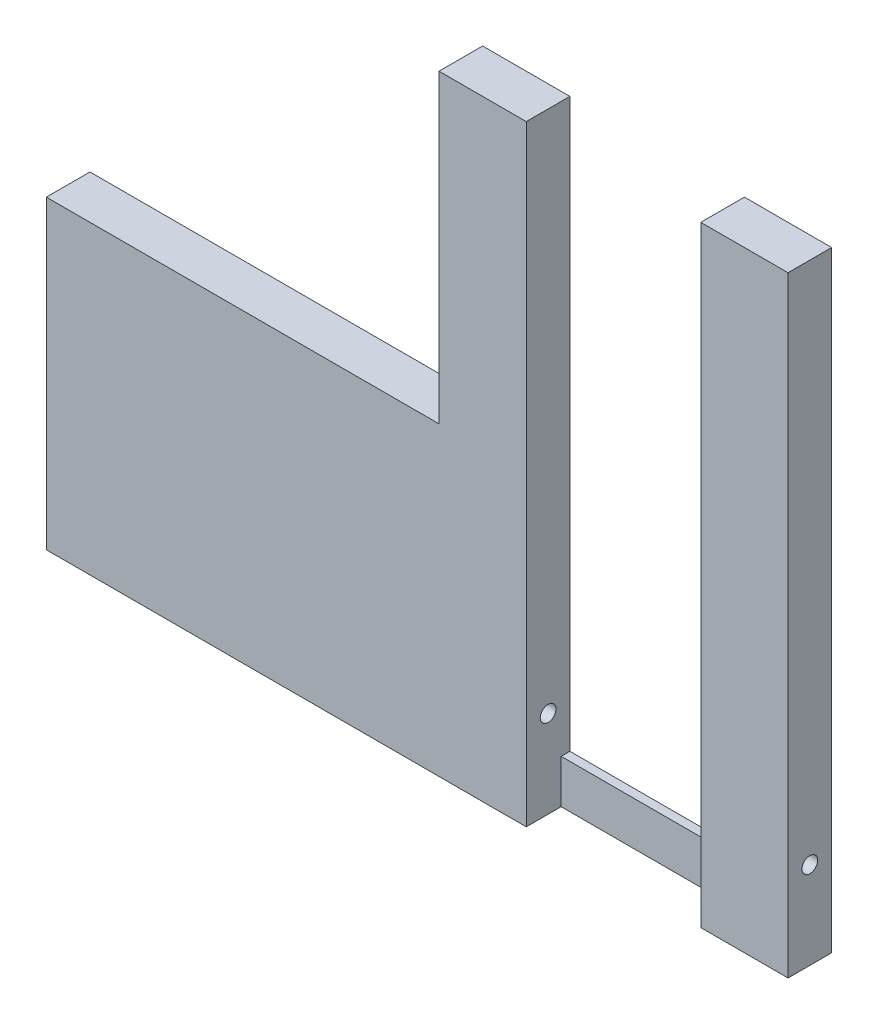
ISO-10303-21;
HEADER;
FILE_DESCRIPTION(('STEP AP214'),'2;1');
FILE_NAME('part.step','',(''),(''),'','','');
FILE_SCHEMA(('AUTOMOTIVE_DESIGN { 1 0 10303 214 1 1 1 1 }'));
ENDSEC;
DATA;
#1=APPLICATION_CONTEXT('core data for automotive mechanical design processes');
#2=APPLICATION_PROTOCOL_DEFINITION('international standard','automotive_design',2000,#1);
#3=PRODUCT_CONTEXT('',#1,'mechanical');
#4=PRODUCT('Part','Part','',(#3));
#5=PRODUCT_RELATED_PRODUCT_CATEGORY('part','',(#4));
#6=PRODUCT_DEFINITION_FORMATION('','',#4);
#7=PRODUCT_DEFINITION_CONTEXT('part definition',#1,'design');
#8=PRODUCT_DEFINITION('design','',#6,#7);
#9=PRODUCT_DEFINITION_SHAPE('','',#8);
#10=(LENGTH_UNIT() NAMED_UNIT(*) SI_UNIT(.MILLI.,.METRE.));
#11=(NAMED_UNIT(*) PLANE_ANGLE_UNIT() SI_UNIT($,.RADIAN.));
#12=(NAMED_UNIT(*) SI_UNIT($,.STERADIAN.) SOLID_ANGLE_UNIT());
#13=UNCERTAINTY_MEASURE_WITH_UNIT(LENGTH_MEASURE(1.E-05),#10,'distance_accuracy_value','');
#14=(GEOMETRIC_REPRESENTATION_CONTEXT(3) GLOBAL_UNCERTAINTY_ASSIGNED_CONTEXT((#13)) GLOBAL_UNIT_ASSIGNED_CONTEXT((#10,
#11,#12)) REPRESENTATION_CONTEXT('',''));
#15=CARTESIAN_POINT('',(0.,0.,0.));
#16=DIRECTION('',(0.,0.,1.));
#17=DIRECTION('',(1.,0.,0.));
#18=AXIS2_PLACEMENT_3D('',#15,#16,#17);
#19=CARTESIAN_POINT('',(0.,0.,2.));
#20=DIRECTION('',(1.,0.,0.));
#21=DIRECTION('',(0.,0.,-1.));
#22=AXIS2_PLACEMENT_3D('',#19,#20,#21);
#23=PLANE('',#22);
#24=DIRECTION('',(0.,0.,-1.));
#25=VECTOR('',#24,1.);
#26=CARTESIAN_POINT('',(0.,14.,0.));
#27=LINE('',#26,#25);
#28=CARTESIAN_POINT('',(0.,14.,2.));
#29=VERTEX_POINT('',#28);
#30=CARTESIAN_POINT('',(0.,14.,0.));
#31=VERTEX_POINT('',#30);
#32=EDGE_CURVE('E55',#29,#31,#27,.T.);
#33=ORIENTED_EDGE('',*,*,#32,.F.);
#34=DIRECTION('',(0.,-1.,0.));
#35=VECTOR('',#34,1.);
#36=CARTESIAN_POINT('',(0.,0.,2.));
#37=LINE('',#36,#35);
#38=CARTESIAN_POINT('',(0.,28.,2.));
#39=VERTEX_POINT('',#38);
#40=EDGE_CURVE('E233',#39,#29,#37,.T.);
#41=ORIENTED_EDGE('',*,*,#40,.F.);
#42=DIRECTION('',(0.,0.,-1.));
#43=VECTOR('',#42,1.);
#44=CARTESIAN_POINT('',(0.,28.,2.));
#45=LINE('',#44,#43);
#46=CARTESIAN_POINT('',(0.,28.,0.));
#47=VERTEX_POINT('',#46);
#48=EDGE_CURVE('E245',#39,#47,#45,.T.);
#49=ORIENTED_EDGE('',*,*,#48,.T.);
#50=DIRECTION('',(0.,-1.,0.));
#51=VECTOR('',#50,1.);
#52=CARTESIAN_POINT('',(0.,0.,0.));
#53=LINE('',#52,#51);
#54=EDGE_CURVE('E143',#47,#31,#53,.T.);
#55=ORIENTED_EDGE('',*,*,#54,.T.);
#56=EDGE_LOOP('',(#33,#41,#49,#55));
#57=FACE_BOUND('',#56,.T.);
#58=ADVANCED_FACE('F40',(#57),#23,.F.);
#59=CARTESIAN_POINT('',(0.,0.,0.400000000000001));
#60=DIRECTION('',(0.,0.,-1.));
#61=DIRECTION('',(-1.,0.,0.));
#62=AXIS2_PLACEMENT_3D('',#59,#60,#61);
#63=PLANE('',#62);
#64=DIRECTION('',(0.,-1.,0.));
#65=VECTOR('',#64,1.);
#66=CARTESIAN_POINT('',(12.,0.,0.400000000000001));
#67=LINE('',#66,#65);
#68=CARTESIAN_POINT('',(12.,2.,0.400000000000001));
#69=VERTEX_POINT('',#68);
#70=CARTESIAN_POINT('',(12.,0.,0.400000000000001));
#71=VERTEX_POINT('',#70);
#72=EDGE_CURVE('E211',#69,#71,#67,.T.);
#73=ORIENTED_EDGE('',*,*,#72,.F.);
#74=DIRECTION('',(1.,0.,0.));
#75=VECTOR('',#74,1.);
#76=CARTESIAN_POINT('',(0.,2.,0.400000000000001));
#77=LINE('',#76,#75);
#78=CARTESIAN_POINT('',(4.,2.,0.400000000000001));
#79=VERTEX_POINT('',#78);
#80=EDGE_CURVE('E215',#79,#69,#77,.T.);
#81=ORIENTED_EDGE('',*,*,#80,.F.);
#82=DIRECTION('',(0.,-1.,0.));
#83=VECTOR('',#82,1.);
#84=CARTESIAN_POINT('',(4.,0.,0.400000000000001));
#85=LINE('',#84,#83);
#86=CARTESIAN_POINT('',(4.,0.,0.400000000000001));
#87=VERTEX_POINT('',#86);
#88=EDGE_CURVE('E48',#79,#87,#85,.T.);
#89=ORIENTED_EDGE('',*,*,#88,.T.);
#90=DIRECTION('',(-1.,0.,0.));
#91=VECTOR('',#90,1.);
#92=CARTESIAN_POINT('',(0.,0.,0.400000000000001));
#93=LINE('',#92,#91);
#94=EDGE_CURVE('E219',#71,#87,#93,.T.);
#95=ORIENTED_EDGE('',*,*,#94,.F.);
#96=EDGE_LOOP('',(#73,#81,#89,#95));
#97=FACE_BOUND('',#96,.T.);
#98=ADVANCED_FACE('F267',(#97),#63,.F.);
#99=CARTESIAN_POINT('',(0.,2.,0.400000000000001));
#100=DIRECTION('',(0.,1.,0.));
#101=DIRECTION('',(-1.,0.,0.));
#102=AXIS2_PLACEMENT_3D('',#99,#100,#101);
#103=PLANE('',#102);
#104=ORIENTED_EDGE('',*,*,#80,.T.);
#105=DIRECTION('',(0.,0.,-1.));
#106=VECTOR('',#105,1.);
#107=CARTESIAN_POINT('',(12.,2.,0.400000000000001));
#108=LINE('',#107,#106);
#109=CARTESIAN_POINT('',(12.,2.,0.));
#110=VERTEX_POINT('',#109);
#111=EDGE_CURVE('E11',#69,#110,#108,.T.);
#112=ORIENTED_EDGE('',*,*,#111,.T.);
#113=DIRECTION('',(1.,0.,0.));
#114=VECTOR('',#113,1.);
#115=CARTESIAN_POINT('',(0.,2.,0.));
#116=LINE('',#115,#114);
#117=CARTESIAN_POINT('',(4.,2.,0.));
#118=VERTEX_POINT('',#117);
#119=EDGE_CURVE('E214',#118,#110,#116,.T.);
#120=ORIENTED_EDGE('',*,*,#119,.F.);
#121=DIRECTION('',(0.,0.,-1.));
#122=VECTOR('',#121,1.);
#123=CARTESIAN_POINT('',(4.,2.,2.));
#124=LINE('',#123,#122);
#125=EDGE_CURVE('E230',#79,#118,#124,.T.);
#126=ORIENTED_EDGE('',*,*,#125,.F.);
#127=EDGE_LOOP('',(#104,#112,#120,#126));
#128=FACE_BOUND('',#127,.T.);
#129=ADVANCED_FACE('F269',(#128),#103,.T.);
#130=CARTESIAN_POINT('',(0.,0.,2.));
#131=DIRECTION('',(0.,1.,0.));
#132=DIRECTION('',(0.,0.,1.));
#133=AXIS2_PLACEMENT_3D('',#130,#131,#132);
#134=PLANE('',#133);
#135=DIRECTION('',(0.,0.,-1.));
#136=VECTOR('',#135,1.);
#137=CARTESIAN_POINT('',(16.,0.,0.400000000000001));
#138=LINE('',#137,#136);
#139=CARTESIAN_POINT('',(16.,0.,2.));
#140=VERTEX_POINT('',#139);
#141=CARTESIAN_POINT('',(16.,0.,0.));
#142=VERTEX_POINT('',#141);
#143=EDGE_CURVE('E222',#140,#142,#138,.T.);
#144=ORIENTED_EDGE('',*,*,#143,.F.);
#145=DIRECTION('',(1.,0.,0.));
#146=VECTOR('',#145,1.);
#147=CARTESIAN_POINT('',(12.,0.,2.));
#148=LINE('',#147,#146);
#149=CARTESIAN_POINT('',(12.,0.,2.));
#150=VERTEX_POINT('',#149);
#151=EDGE_CURVE('E184',#150,#140,#148,.T.);
#152=ORIENTED_EDGE('',*,*,#151,.F.);
#153=DIRECTION('',(0.,0.,-1.));
#154=VECTOR('',#153,1.);
#155=CARTESIAN_POINT('',(12.,0.,2.));
#156=LINE('',#155,#154);
#157=EDGE_CURVE('E207',#150,#71,#156,.T.);
#158=ORIENTED_EDGE('',*,*,#157,.T.);
#159=ORIENTED_EDGE('',*,*,#94,.T.);
#160=DIRECTION('',(0.,0.,-1.));
#161=VECTOR('',#160,1.);
#162=CARTESIAN_POINT('',(4.,0.,2.));
#163=LINE('',#162,#161);
#164=CARTESIAN_POINT('',(4.,0.,2.));
#165=VERTEX_POINT('',#164);
#166=EDGE_CURVE('E259',#165,#87,#163,.T.);
#167=ORIENTED_EDGE('',*,*,#166,.F.);
#168=DIRECTION('',(1.,0.,0.));
#169=VECTOR('',#168,1.);
#170=CARTESIAN_POINT('',(0.,0.,2.));
#171=LINE('',#170,#169);
#172=CARTESIAN_POINT('',(-18.,0.,2.));
#173=VERTEX_POINT('',#172);
#174=EDGE_CURVE('E149',#173,#165,#171,.T.);
#175=ORIENTED_EDGE('',*,*,#174,.F.);
#176=DIRECTION('',(0.,0.,1.));
#177=VECTOR('',#176,1.);
#178=CARTESIAN_POINT('',(-18.,0.,0.));
#179=LINE('',#178,#177);
#180=CARTESIAN_POINT('',(-18.,0.,0.));
#181=VERTEX_POINT('',#180);
#182=EDGE_CURVE('E146',#181,#173,#179,.T.);
#183=ORIENTED_EDGE('',*,*,#182,.F.);
#184=DIRECTION('',(1.,0.,0.));
#185=VECTOR('',#184,1.);
#186=CARTESIAN_POINT('',(0.,0.,0.));
#187=LINE('',#186,#185);
#188=EDGE_CURVE('E131',#181,#142,#187,.T.);
#189=ORIENTED_EDGE('',*,*,#188,.T.);
#190=EDGE_LOOP('',(#144,#152,#158,#159,#167,#175,#183,#189));
#191=FACE_BOUND('',#190,.T.);
#192=ADVANCED_FACE('F147',(#191),#134,.F.);
#193=CARTESIAN_POINT('',(4.,0.,2.));
#194=DIRECTION('',(-1.,0.,0.));
#195=DIRECTION('',(0.,0.,1.));
#196=AXIS2_PLACEMENT_3D('',#193,#194,#195);
#197=PLANE('',#196);
#198=CARTESIAN_POINT('',(4.,4.,1.));
#199=DIRECTION('',(-1.,0.,0.));
#200=DIRECTION('',(0.,0.,1.));
#201=AXIS2_PLACEMENT_3D('',#198,#199,#200);
#202=CIRCLE('',#201,0.36);
#203=CARTESIAN_POINT('',(4.,4.,1.36));
#204=VERTEX_POINT('',#203);
#205=EDGE_CURVE('E163',#204,#204,#202,.T.);
#206=ORIENTED_EDGE('',*,*,#205,.T.);
#207=EDGE_LOOP('',(#206));
#208=FACE_BOUND('',#207,.T.);
#209=ORIENTED_EDGE('',*,*,#88,.F.);
#210=ORIENTED_EDGE('',*,*,#125,.T.);
#211=DIRECTION('',(0.,1.,0.));
#212=VECTOR('',#211,1.);
#213=CARTESIAN_POINT('',(4.,0.,0.));
#214=LINE('',#213,#212);
#215=CARTESIAN_POINT('',(4.,28.,0.));
#216=VERTEX_POINT('',#215);
#217=EDGE_CURVE('E142',#118,#216,#214,.T.);
#218=ORIENTED_EDGE('',*,*,#217,.T.);
#219=DIRECTION('',(0.,0.,-1.));
#220=VECTOR('',#219,1.);
#221=CARTESIAN_POINT('',(4.,28.,2.));
#222=LINE('',#221,#220);
#223=CARTESIAN_POINT('',(4.,28.,2.));
#224=VERTEX_POINT('',#223);
#225=EDGE_CURVE('E255',#224,#216,#222,.T.);
#226=ORIENTED_EDGE('',*,*,#225,.F.);
#227=DIRECTION('',(0.,1.,0.));
#228=VECTOR('',#227,1.);
#229=CARTESIAN_POINT('',(4.,0.,2.));
#230=LINE('',#229,#228);
#231=EDGE_CURVE('E239',#165,#224,#230,.T.);
#232=ORIENTED_EDGE('',*,*,#231,.F.);
#233=ORIENTED_EDGE('',*,*,#166,.T.);
#234=EDGE_LOOP('',(#209,#210,#218,#226,#232,#233));
#235=FACE_BOUND('',#234,.T.);
#236=ADVANCED_FACE('F271',(#208,#235),#197,.F.);
#237=CARTESIAN_POINT('',(0.,28.,2.));
#238=DIRECTION('',(0.,-1.,0.));
#239=DIRECTION('',(0.,0.,-1.));
#240=AXIS2_PLACEMENT_3D('',#237,#238,#239);
#241=PLANE('',#240);
#242=DIRECTION('',(-1.,0.,0.));
#243=VECTOR('',#242,1.);
#244=CARTESIAN_POINT('',(0.,28.,0.));
#245=LINE('',#244,#243);
#246=EDGE_CURVE('E236',#216,#47,#245,.T.);
#247=ORIENTED_EDGE('',*,*,#246,.T.);
#248=ORIENTED_EDGE('',*,*,#48,.F.);
#249=DIRECTION('',(-1.,0.,0.));
#250=VECTOR('',#249,1.);
#251=CARTESIAN_POINT('',(0.,28.,2.));
#252=LINE('',#251,#250);
#253=EDGE_CURVE('E242',#224,#39,#252,.T.);
#254=ORIENTED_EDGE('',*,*,#253,.F.);
#255=ORIENTED_EDGE('',*,*,#225,.T.);
#256=EDGE_LOOP('',(#247,#248,#254,#255));
#257=FACE_BOUND('',#256,.T.);
#258=ADVANCED_FACE('F277',(#257),#241,.F.);
#259=CARTESIAN_POINT('',(0.,0.,2.));
#260=DIRECTION('',(0.,0.,-1.));
#261=DIRECTION('',(-1.,0.,0.));
#262=AXIS2_PLACEMENT_3D('',#259,#260,#261);
#263=PLANE('',#262);
#264=ORIENTED_EDGE('',*,*,#40,.T.);
#265=DIRECTION('',(1.,0.,0.));
#266=VECTOR('',#265,1.);
#267=CARTESIAN_POINT('',(-18.,14.,2.));
#268=LINE('',#267,#266);
#269=CARTESIAN_POINT('',(-18.,14.,2.));
#270=VERTEX_POINT('',#269);
#271=EDGE_CURVE('E175',#270,#29,#268,.T.);
#272=ORIENTED_EDGE('',*,*,#271,.F.);
#273=DIRECTION('',(0.,1.,0.));
#274=VECTOR('',#273,1.);
#275=CARTESIAN_POINT('',(-18.,0.,2.));
#276=LINE('',#275,#274);
#277=EDGE_CURVE('E153',#173,#270,#276,.T.);
#278=ORIENTED_EDGE('',*,*,#277,.F.);
#279=ORIENTED_EDGE('',*,*,#174,.T.);
#280=ORIENTED_EDGE('',*,*,#231,.T.);
#281=ORIENTED_EDGE('',*,*,#253,.T.);
#282=EDGE_LOOP('',(#264,#272,#278,#279,#280,#281));
#283=FACE_BOUND('',#282,.T.);
#284=ADVANCED_FACE('F284',(#283),#263,.F.);
#285=CARTESIAN_POINT('',(0.,0.,0.));
#286=DIRECTION('',(0.,0.,-1.));
#287=DIRECTION('',(-1.,0.,0.));
#288=AXIS2_PLACEMENT_3D('',#285,#286,#287);
#289=PLANE('',#288);
#290=DIRECTION('',(0.,-1.,0.));
#291=VECTOR('',#290,1.);
#292=CARTESIAN_POINT('',(16.,0.,0.));
#293=LINE('',#292,#291);
#294=CARTESIAN_POINT('',(16.,28.,0.));
#295=VERTEX_POINT('',#294);
#296=EDGE_CURVE('E138',#295,#142,#293,.T.);
#297=ORIENTED_EDGE('',*,*,#296,.T.);
#298=ORIENTED_EDGE('',*,*,#188,.F.);
#299=DIRECTION('',(0.,-1.,0.));
#300=VECTOR('',#299,1.);
#301=CARTESIAN_POINT('',(-18.,0.,0.));
#302=LINE('',#301,#300);
#303=CARTESIAN_POINT('',(-18.,14.,0.));
#304=VERTEX_POINT('',#303);
#305=EDGE_CURVE('E136',#304,#181,#302,.T.);
#306=ORIENTED_EDGE('',*,*,#305,.F.);
#307=DIRECTION('',(1.,0.,0.));
#308=VECTOR('',#307,1.);
#309=CARTESIAN_POINT('',(-18.,14.,0.));
#310=LINE('',#309,#308);
#311=EDGE_CURVE('E171',#304,#31,#310,.T.);
#312=ORIENTED_EDGE('',*,*,#311,.T.);
#313=ORIENTED_EDGE('',*,*,#54,.F.);
#314=ORIENTED_EDGE('',*,*,#246,.F.);
#315=ORIENTED_EDGE('',*,*,#217,.F.);
#316=ORIENTED_EDGE('',*,*,#119,.T.);
#317=DIRECTION('',(0.,-1.,0.));
#318=VECTOR('',#317,1.);
#319=CARTESIAN_POINT('',(12.,0.,0.));
#320=LINE('',#319,#318);
#321=CARTESIAN_POINT('',(12.,28.,0.));
#322=VERTEX_POINT('',#321);
#323=EDGE_CURVE('E179',#322,#110,#320,.T.);
#324=ORIENTED_EDGE('',*,*,#323,.F.);
#325=DIRECTION('',(-1.,0.,0.));
#326=VECTOR('',#325,1.);
#327=CARTESIAN_POINT('',(12.,28.,0.));
#328=LINE('',#327,#326);
#329=EDGE_CURVE('E185',#295,#322,#328,.T.);
#330=ORIENTED_EDGE('',*,*,#329,.F.);
#331=EDGE_LOOP('',(#297,#298,#306,#312,#313,#314,#315,#316,#324,#330));
#332=FACE_BOUND('',#331,.T.);
#333=ADVANCED_FACE('F133',(#332),#289,.T.);
#334=CARTESIAN_POINT('',(16.,0.,0.400000000000001));
#335=DIRECTION('',(1.,0.,0.));
#336=DIRECTION('',(0.,0.,-1.));
#337=AXIS2_PLACEMENT_3D('',#334,#335,#336);
#338=PLANE('',#337);
#339=CARTESIAN_POINT('',(16.,4.,1.));
#340=DIRECTION('',(1.,0.,0.));
#341=DIRECTION('',(0.,0.,-1.));
#342=AXIS2_PLACEMENT_3D('',#339,#340,#341);
#343=CIRCLE('',#342,0.36);
#344=CARTESIAN_POINT('',(16.,4.,0.640000000000001));
#345=VERTEX_POINT('',#344);
#346=EDGE_CURVE('E411',#345,#345,#343,.T.);
#347=ORIENTED_EDGE('',*,*,#346,.F.);
#348=EDGE_LOOP('',(#347));
#349=FACE_BOUND('',#348,.T.);
#350=DIRECTION('',(0.,1.,0.));
#351=VECTOR('',#350,1.);
#352=CARTESIAN_POINT('',(16.,0.,2.));
#353=LINE('',#352,#351);
#354=CARTESIAN_POINT('',(16.,28.,2.));
#355=VERTEX_POINT('',#354);
#356=EDGE_CURVE('E189',#140,#355,#353,.T.);
#357=ORIENTED_EDGE('',*,*,#356,.F.);
#358=ORIENTED_EDGE('',*,*,#143,.T.);
#359=ORIENTED_EDGE('',*,*,#296,.F.);
#360=DIRECTION('',(0.,0.,-1.));
#361=VECTOR('',#360,1.);
#362=CARTESIAN_POINT('',(16.,28.,2.));
#363=LINE('',#362,#361);
#364=EDGE_CURVE('E203',#355,#295,#363,.T.);
#365=ORIENTED_EDGE('',*,*,#364,.F.);
#366=EDGE_LOOP('',(#357,#358,#359,#365));
#367=FACE_BOUND('',#366,.T.);
#368=ADVANCED_FACE('F297',(#349,#367),#338,.T.);
#369=CARTESIAN_POINT('',(12.,0.,2.));
#370=DIRECTION('',(1.,0.,0.));
#371=DIRECTION('',(0.,0.,-1.));
#372=AXIS2_PLACEMENT_3D('',#369,#370,#371);
#373=PLANE('',#372);
#374=CARTESIAN_POINT('',(12.,4.,1.));
#375=DIRECTION('',(1.,0.,0.));
#376=DIRECTION('',(0.,0.,-1.));
#377=AXIS2_PLACEMENT_3D('',#374,#375,#376);
#378=CIRCLE('',#377,0.36);
#379=CARTESIAN_POINT('',(12.,4.,0.640000000000001));
#380=VERTEX_POINT('',#379);
#381=EDGE_CURVE('E414',#380,#380,#378,.T.);
#382=ORIENTED_EDGE('',*,*,#381,.T.);
#383=EDGE_LOOP('',(#382));
#384=FACE_BOUND('',#383,.T.);
#385=ORIENTED_EDGE('',*,*,#111,.F.);
#386=ORIENTED_EDGE('',*,*,#72,.T.);
#387=ORIENTED_EDGE('',*,*,#157,.F.);
#388=DIRECTION('',(0.,-1.,0.));
#389=VECTOR('',#388,1.);
#390=CARTESIAN_POINT('',(12.,0.,2.));
#391=LINE('',#390,#389);
#392=CARTESIAN_POINT('',(12.,28.,2.));
#393=VERTEX_POINT('',#392);
#394=EDGE_CURVE('E180',#393,#150,#391,.T.);
#395=ORIENTED_EDGE('',*,*,#394,.F.);
#396=DIRECTION('',(0.,0.,-1.));
#397=VECTOR('',#396,1.);
#398=CARTESIAN_POINT('',(12.,28.,2.));
#399=LINE('',#398,#397);
#400=EDGE_CURVE('E195',#393,#322,#399,.T.);
#401=ORIENTED_EDGE('',*,*,#400,.T.);
#402=ORIENTED_EDGE('',*,*,#323,.T.);
#403=EDGE_LOOP('',(#385,#386,#387,#395,#401,#402));
#404=FACE_BOUND('',#403,.T.);
#405=ADVANCED_FACE('F288',(#384,#404),#373,.F.);
#406=CARTESIAN_POINT('',(12.,28.,2.));
#407=DIRECTION('',(0.,-1.,0.));
#408=DIRECTION('',(0.,0.,-1.));
#409=AXIS2_PLACEMENT_3D('',#406,#407,#408);
#410=PLANE('',#409);
#411=ORIENTED_EDGE('',*,*,#329,.T.);
#412=ORIENTED_EDGE('',*,*,#400,.F.);
#413=DIRECTION('',(-1.,0.,0.));
#414=VECTOR('',#413,1.);
#415=CARTESIAN_POINT('',(12.,28.,2.));
#416=LINE('',#415,#414);
#417=EDGE_CURVE('E192',#355,#393,#416,.T.);
#418=ORIENTED_EDGE('',*,*,#417,.F.);
#419=ORIENTED_EDGE('',*,*,#364,.T.);
#420=EDGE_LOOP('',(#411,#412,#418,#419));
#421=FACE_BOUND('',#420,.T.);
#422=ADVANCED_FACE('F292',(#421),#410,.F.);
#423=CARTESIAN_POINT('',(0.,0.,2.));
#424=DIRECTION('',(0.,0.,-1.));
#425=DIRECTION('',(-1.,0.,0.));
#426=AXIS2_PLACEMENT_3D('',#423,#424,#425);
#427=PLANE('',#426);
#428=ORIENTED_EDGE('',*,*,#394,.T.);
#429=ORIENTED_EDGE('',*,*,#151,.T.);
#430=ORIENTED_EDGE('',*,*,#356,.T.);
#431=ORIENTED_EDGE('',*,*,#417,.T.);
#432=EDGE_LOOP('',(#428,#429,#430,#431));
#433=FACE_BOUND('',#432,.T.);
#434=ADVANCED_FACE('F299',(#433),#427,.F.);
#435=CARTESIAN_POINT('',(-18.,14.,0.));
#436=DIRECTION('',(0.,-1.,0.));
#437=DIRECTION('',(0.,0.,-1.));
#438=AXIS2_PLACEMENT_3D('',#435,#436,#437);
#439=PLANE('',#438);
#440=ORIENTED_EDGE('',*,*,#32,.T.);
#441=ORIENTED_EDGE('',*,*,#311,.F.);
#442=DIRECTION('',(0.,0.,-1.));
#443=VECTOR('',#442,1.);
#444=CARTESIAN_POINT('',(-18.,14.,0.));
#445=LINE('',#444,#443);
#446=EDGE_CURVE('E157',#270,#304,#445,.T.);
#447=ORIENTED_EDGE('',*,*,#446,.F.);
#448=ORIENTED_EDGE('',*,*,#271,.T.);
#449=EDGE_LOOP('',(#440,#441,#447,#448));
#450=FACE_BOUND('',#449,.T.);
#451=ADVANCED_FACE('F281',(#450),#439,.F.);
#452=CARTESIAN_POINT('',(-18.,0.,0.));
#453=DIRECTION('',(1.,0.,0.));
#454=DIRECTION('',(0.,0.,-1.));
#455=AXIS2_PLACEMENT_3D('',#452,#453,#454);
#456=PLANE('',#455);
#457=CARTESIAN_POINT('',(-18.,4.,1.));
#458=DIRECTION('',(1.,0.,0.));
#459=DIRECTION('',(0.,0.,-1.));
#460=AXIS2_PLACEMENT_3D('',#457,#458,#459);
#461=CIRCLE('',#460,0.36);
#462=CARTESIAN_POINT('',(-18.,4.,0.640000000000001));
#463=VERTEX_POINT('',#462);
#464=EDGE_CURVE('E416',#463,#463,#461,.T.);
#465=ORIENTED_EDGE('',*,*,#464,.T.);
#466=EDGE_LOOP('',(#465));
#467=FACE_BOUND('',#466,.T.);
#468=ORIENTED_EDGE('',*,*,#305,.T.);
#469=ORIENTED_EDGE('',*,*,#182,.T.);
#470=ORIENTED_EDGE('',*,*,#277,.T.);
#471=ORIENTED_EDGE('',*,*,#446,.T.);
#472=EDGE_LOOP('',(#468,#469,#470,#471));
#473=FACE_BOUND('',#472,.T.);
#474=ADVANCED_FACE('F155',(#467,#473),#456,.F.);
#475=CARTESIAN_POINT('',(-18.,4.,1.));
#476=DIRECTION('',(1.,0.,0.));
#477=DIRECTION('',(0.,0.,-1.));
#478=AXIS2_PLACEMENT_3D('',#475,#476,#477);
#479=CYLINDRICAL_SURFACE('',#478,0.36);
#480=ORIENTED_EDGE('',*,*,#464,.F.);
#481=EDGE_LOOP('',(#480));
#482=FACE_BOUND('',#481,.T.);
#483=ORIENTED_EDGE('',*,*,#205,.F.);
#484=EDGE_LOOP('',(#483));
#485=FACE_BOUND('',#484,.T.);
#486=ADVANCED_FACE('F385',(#482,#485),#479,.F.);
#487=ORIENTED_EDGE('',*,*,#346,.T.);
#488=EDGE_LOOP('',(#487));
#489=FACE_BOUND('',#488,.T.);
#490=ORIENTED_EDGE('',*,*,#381,.F.);
#491=EDGE_LOOP('',(#490));
#492=FACE_BOUND('',#491,.T.);
#493=ADVANCED_FACE('F395',(#489,#492),#479,.F.);
#494=CLOSED_SHELL('',(#58,#98,#129,#192,#236,#258,#284,#333,#368,#405,#422,#434,#451,#474,#486,#493));
#495=MANIFOLD_SOLID_BREP('B2',#494);
#496=ADVANCED_BREP_SHAPE_REPRESENTATION('',(#18,#495),#14);
#497=SHAPE_DEFINITION_REPRESENTATION(#9,#496);
ENDSEC;
END-ISO-10303-21;
